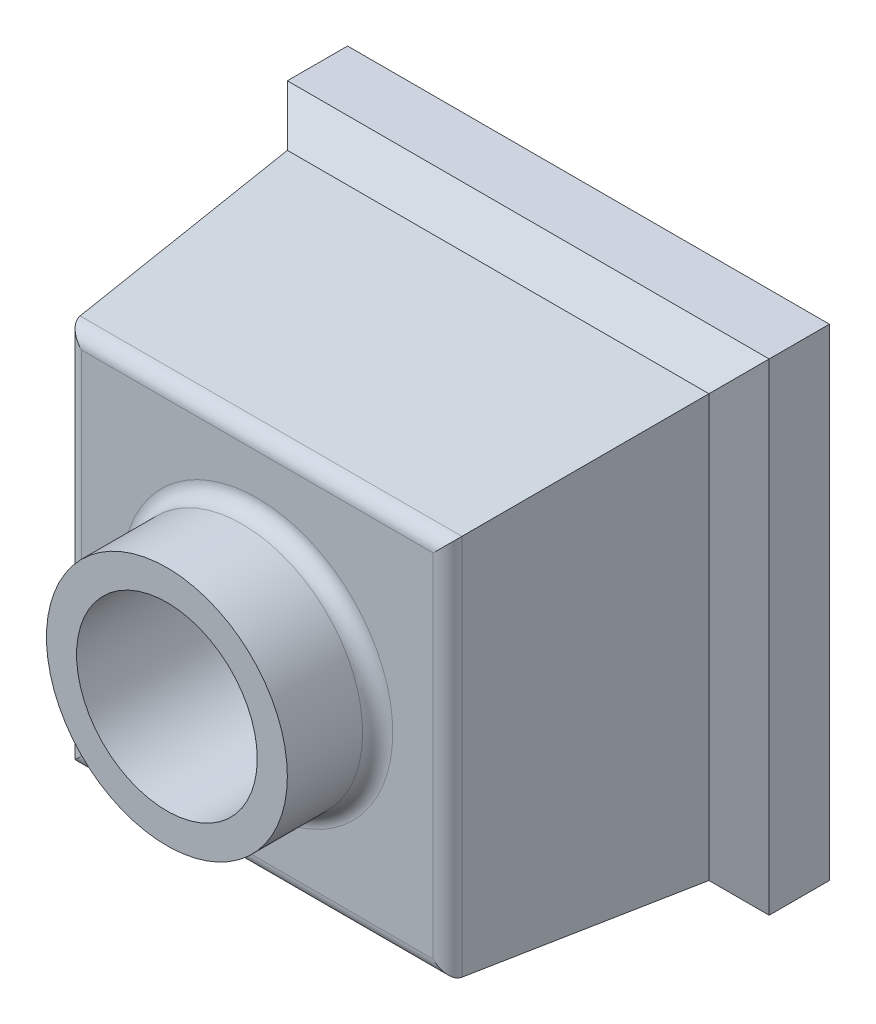
ISO-10303-21;
HEADER;
FILE_DESCRIPTION(('STEP AP214'),'2;1');
FILE_NAME('part.step','',(''),(''),'','','');
FILE_SCHEMA(('AUTOMOTIVE_DESIGN { 1 0 10303 214 1 1 1 1 }'));
ENDSEC;
DATA;
#1=APPLICATION_CONTEXT('core data for automotive mechanical design processes');
#2=APPLICATION_PROTOCOL_DEFINITION('international standard','automotive_design',2000,#1);
#3=PRODUCT_CONTEXT('',#1,'mechanical');
#4=PRODUCT('Part','Part','',(#3));
#5=PRODUCT_RELATED_PRODUCT_CATEGORY('part','',(#4));
#6=PRODUCT_DEFINITION_FORMATION('','',#4);
#7=PRODUCT_DEFINITION_CONTEXT('part definition',#1,'design');
#8=PRODUCT_DEFINITION('design','',#6,#7);
#9=PRODUCT_DEFINITION_SHAPE('','',#8);
#10=(LENGTH_UNIT() NAMED_UNIT(*) SI_UNIT(.MILLI.,.METRE.));
#11=(NAMED_UNIT(*) PLANE_ANGLE_UNIT() SI_UNIT($,.RADIAN.));
#12=(NAMED_UNIT(*) SI_UNIT($,.STERADIAN.) SOLID_ANGLE_UNIT());
#13=UNCERTAINTY_MEASURE_WITH_UNIT(LENGTH_MEASURE(1.E-05),#10,'distance_accuracy_value','');
#14=(GEOMETRIC_REPRESENTATION_CONTEXT(3) GLOBAL_UNCERTAINTY_ASSIGNED_CONTEXT((#13)) GLOBAL_UNIT_ASSIGNED_CONTEXT((#10,
#11,#12)) REPRESENTATION_CONTEXT('',''));
#15=CARTESIAN_POINT('',(0.,0.,0.));
#16=DIRECTION('',(0.,0.,1.));
#17=DIRECTION('',(1.,0.,0.));
#18=AXIS2_PLACEMENT_3D('',#15,#16,#17);
#19=CARTESIAN_POINT('',(0.,0.,30.));
#20=DIRECTION('',(1.,0.,0.));
#21=DIRECTION('',(0.,0.,-1.));
#22=AXIS2_PLACEMENT_3D('',#19,#20,#21);
#23=PLANE('',#22);
#24=DIRECTION('',(0.,0.,-1.));
#25=VECTOR('',#24,1.);
#26=CARTESIAN_POINT('',(0.,0.,30.));
#27=LINE('',#26,#25);
#28=CARTESIAN_POINT('',(0.,0.,20.));
#29=VERTEX_POINT('',#28);
#30=CARTESIAN_POINT('',(0.,0.,0.));
#31=VERTEX_POINT('',#30);
#32=EDGE_CURVE('E189',#29,#31,#27,.T.);
#33=ORIENTED_EDGE('',*,*,#32,.F.);
#34=DIRECTION('',(0.,1.,0.));
#35=VECTOR('',#34,1.);
#36=CARTESIAN_POINT('',(0.,0.,20.));
#37=LINE('',#36,#35);
#38=CARTESIAN_POINT('',(0.,160.,20.));
#39=VERTEX_POINT('',#38);
#40=EDGE_CURVE('E153',#29,#39,#37,.T.);
#41=ORIENTED_EDGE('',*,*,#40,.T.);
#42=DIRECTION('',(0.,0.,-1.));
#43=VECTOR('',#42,1.);
#44=CARTESIAN_POINT('',(0.,160.,30.));
#45=LINE('',#44,#43);
#46=CARTESIAN_POINT('',(0.,160.,0.));
#47=VERTEX_POINT('',#46);
#48=EDGE_CURVE('E199',#39,#47,#45,.T.);
#49=ORIENTED_EDGE('',*,*,#48,.T.);
#50=DIRECTION('',(0.,-1.,0.));
#51=VECTOR('',#50,1.);
#52=CARTESIAN_POINT('',(0.,0.,0.));
#53=LINE('',#52,#51);
#54=EDGE_CURVE('E210',#47,#31,#53,.T.);
#55=ORIENTED_EDGE('',*,*,#54,.T.);
#56=EDGE_LOOP('',(#33,#41,#49,#55));
#57=FACE_BOUND('',#56,.T.);
#58=ADVANCED_FACE('F33',(#57),#23,.F.);
#59=CARTESIAN_POINT('',(0.,0.,30.));
#60=DIRECTION('',(0.,1.,0.));
#61=DIRECTION('',(0.,0.,1.));
#62=AXIS2_PLACEMENT_3D('',#59,#60,#61);
#63=PLANE('',#62);
#64=DIRECTION('',(0.,0.,-1.));
#65=VECTOR('',#64,1.);
#66=CARTESIAN_POINT('',(160.,0.,30.));
#67=LINE('',#66,#65);
#68=CARTESIAN_POINT('',(160.,0.,20.));
#69=VERTEX_POINT('',#68);
#70=CARTESIAN_POINT('',(160.,0.,0.));
#71=VERTEX_POINT('',#70);
#72=EDGE_CURVE('E195',#69,#71,#67,.T.);
#73=ORIENTED_EDGE('',*,*,#72,.F.);
#74=DIRECTION('',(-1.,0.,0.));
#75=VECTOR('',#74,1.);
#76=CARTESIAN_POINT('',(0.,0.,20.));
#77=LINE('',#76,#75);
#78=EDGE_CURVE('E144',#69,#29,#77,.T.);
#79=ORIENTED_EDGE('',*,*,#78,.T.);
#80=ORIENTED_EDGE('',*,*,#32,.T.);
#81=DIRECTION('',(1.,0.,0.));
#82=VECTOR('',#81,1.);
#83=CARTESIAN_POINT('',(0.,0.,0.));
#84=LINE('',#83,#82);
#85=EDGE_CURVE('E207',#31,#71,#84,.T.);
#86=ORIENTED_EDGE('',*,*,#85,.T.);
#87=EDGE_LOOP('',(#73,#79,#80,#86));
#88=FACE_BOUND('',#87,.T.);
#89=ADVANCED_FACE('F245',(#88),#63,.F.);
#90=CARTESIAN_POINT('',(160.,0.,30.));
#91=DIRECTION('',(-1.,0.,0.));
#92=DIRECTION('',(0.,0.,1.));
#93=AXIS2_PLACEMENT_3D('',#90,#91,#92);
#94=PLANE('',#93);
#95=DIRECTION('',(0.,0.,-1.));
#96=VECTOR('',#95,1.);
#97=CARTESIAN_POINT('',(160.,160.,30.));
#98=LINE('',#97,#96);
#99=CARTESIAN_POINT('',(160.,160.,20.));
#100=VERTEX_POINT('',#99);
#101=CARTESIAN_POINT('',(160.,160.,0.));
#102=VERTEX_POINT('',#101);
#103=EDGE_CURVE('E197',#100,#102,#98,.T.);
#104=ORIENTED_EDGE('',*,*,#103,.F.);
#105=DIRECTION('',(0.,-1.,0.));
#106=VECTOR('',#105,1.);
#107=CARTESIAN_POINT('',(160.,0.,20.));
#108=LINE('',#107,#106);
#109=EDGE_CURVE('E42',#100,#69,#108,.T.);
#110=ORIENTED_EDGE('',*,*,#109,.T.);
#111=ORIENTED_EDGE('',*,*,#72,.T.);
#112=DIRECTION('',(0.,1.,0.));
#113=VECTOR('',#112,1.);
#114=CARTESIAN_POINT('',(160.,0.,0.));
#115=LINE('',#114,#113);
#116=EDGE_CURVE('E204',#71,#102,#115,.T.);
#117=ORIENTED_EDGE('',*,*,#116,.T.);
#118=EDGE_LOOP('',(#104,#110,#111,#117));
#119=FACE_BOUND('',#118,.T.);
#120=ADVANCED_FACE('F252',(#119),#94,.F.);
#121=CARTESIAN_POINT('',(0.,160.,30.));
#122=DIRECTION('',(0.,-1.,0.));
#123=DIRECTION('',(0.,0.,-1.));
#124=AXIS2_PLACEMENT_3D('',#121,#122,#123);
#125=PLANE('',#124);
#126=ORIENTED_EDGE('',*,*,#48,.F.);
#127=DIRECTION('',(1.,0.,0.));
#128=VECTOR('',#127,1.);
#129=CARTESIAN_POINT('',(0.,160.,20.));
#130=LINE('',#129,#128);
#131=EDGE_CURVE('E11',#39,#100,#130,.T.);
#132=ORIENTED_EDGE('',*,*,#131,.T.);
#133=ORIENTED_EDGE('',*,*,#103,.T.);
#134=DIRECTION('',(-1.,0.,0.));
#135=VECTOR('',#134,1.);
#136=CARTESIAN_POINT('',(0.,160.,0.));
#137=LINE('',#136,#135);
#138=EDGE_CURVE('E201',#102,#47,#137,.T.);
#139=ORIENTED_EDGE('',*,*,#138,.T.);
#140=EDGE_LOOP('',(#126,#132,#133,#139));
#141=FACE_BOUND('',#140,.T.);
#142=ADVANCED_FACE('F305',(#141),#125,.F.);
#143=CARTESIAN_POINT('',(0.,0.,0.));
#144=DIRECTION('',(0.,0.,-1.));
#145=DIRECTION('',(-1.,0.,0.));
#146=AXIS2_PLACEMENT_3D('',#143,#144,#145);
#147=PLANE('',#146);
#148=CARTESIAN_POINT('',(80.,80.,0.));
#149=DIRECTION('',(0.,0.,1.));
#150=DIRECTION('',(1.,0.,0.));
#151=AXIS2_PLACEMENT_3D('',#148,#149,#150);
#152=CIRCLE('',#151,30.);
#153=CARTESIAN_POINT('',(110.,80.,0.));
#154=VERTEX_POINT('',#153);
#155=EDGE_CURVE('E160',#154,#154,#152,.T.);
#156=ORIENTED_EDGE('',*,*,#155,.T.);
#157=EDGE_LOOP('',(#156));
#158=FACE_BOUND('',#157,.T.);
#159=ORIENTED_EDGE('',*,*,#54,.F.);
#160=ORIENTED_EDGE('',*,*,#138,.F.);
#161=ORIENTED_EDGE('',*,*,#116,.F.);
#162=ORIENTED_EDGE('',*,*,#85,.F.);
#163=EDGE_LOOP('',(#159,#160,#161,#162));
#164=FACE_BOUND('',#163,.T.);
#165=ADVANCED_FACE('F225',(#158,#164),#147,.T.);
#166=CARTESIAN_POINT('',(10.,150.,30.));
#167=DIRECTION('',(-0.996194698091746,0.,0.0871557427476582));
#168=DIRECTION('',(0.0871557427476582,0.,0.996194698091746));
#169=AXIS2_PLACEMENT_3D('',#166,#167,#168);
#170=PLANE('',#169);
#171=DIRECTION('',(-0.0868265938642476,-0.0868265938642476,-0.992432509138967));
#172=VECTOR('',#171,1.);
#173=CARTESIAN_POINT('',(10.,10.,30.));
#174=LINE('',#173,#172);
#175=CARTESIAN_POINT('',(16.5997754617023,16.5997754617023,105.435778713738));
#176=VERTEX_POINT('',#175);
#177=CARTESIAN_POINT('',(10.,10.,30.));
#178=VERTEX_POINT('',#177);
#179=EDGE_CURVE('E121',#176,#178,#174,.T.);
#180=ORIENTED_EDGE('',*,*,#179,.F.);
#181=DIRECTION('',(0.,-1.,0.));
#182=VECTOR('',#181,1.);
#183=CARTESIAN_POINT('',(16.5997754617023,143.000906917926,105.435778713738));
#184=LINE('',#183,#182);
#185=CARTESIAN_POINT('',(16.5997754617023,143.400224538298,105.435778713738));
#186=VERTEX_POINT('',#185);
#187=EDGE_CURVE('E169',#176,#186,#184,.F.);
#188=ORIENTED_EDGE('',*,*,#187,.T.);
#189=DIRECTION('',(-0.0868265938642476,0.0868265938642476,-0.992432509138967));
#190=VECTOR('',#189,1.);
#191=CARTESIAN_POINT('',(10.,150.,30.));
#192=LINE('',#191,#190);
#193=CARTESIAN_POINT('',(10.,150.,30.));
#194=VERTEX_POINT('',#193);
#195=EDGE_CURVE('E214',#186,#194,#192,.T.);
#196=ORIENTED_EDGE('',*,*,#195,.T.);
#197=DIRECTION('',(0.,-1.,0.));
#198=VECTOR('',#197,1.);
#199=CARTESIAN_POINT('',(10.,150.,30.));
#200=LINE('',#199,#198);
#201=EDGE_CURVE('E133',#194,#178,#200,.T.);
#202=ORIENTED_EDGE('',*,*,#201,.T.);
#203=EDGE_LOOP('',(#180,#188,#196,#202));
#204=FACE_BOUND('',#203,.T.);
#205=ADVANCED_FACE('F303',(#204),#170,.T.);
#206=CARTESIAN_POINT('',(10.,10.,30.));
#207=DIRECTION('',(0.,-0.996194698091746,0.0871557427476582));
#208=DIRECTION('',(0.,-0.0871557427476582,-0.996194698091746));
#209=AXIS2_PLACEMENT_3D('',#206,#207,#208);
#210=PLANE('',#209);
#211=DIRECTION('',(0.0868265938642476,-0.0868265938642476,-0.992432509138967));
#212=VECTOR('',#211,1.);
#213=CARTESIAN_POINT('',(150.,10.,30.));
#214=LINE('',#213,#212);
#215=CARTESIAN_POINT('',(143.400224538298,16.5997754617023,105.435778713738));
#216=VERTEX_POINT('',#215);
#217=CARTESIAN_POINT('',(150.,10.,30.));
#218=VERTEX_POINT('',#217);
#219=EDGE_CURVE('E110',#216,#218,#214,.T.);
#220=ORIENTED_EDGE('',*,*,#219,.F.);
#221=DIRECTION('',(1.,0.,0.));
#222=VECTOR('',#221,1.);
#223=CARTESIAN_POINT('',(16.9990930820739,16.5997754617023,105.435778713738));
#224=LINE('',#223,#222);
#225=EDGE_CURVE('E171',#216,#176,#224,.F.);
#226=ORIENTED_EDGE('',*,*,#225,.T.);
#227=ORIENTED_EDGE('',*,*,#179,.T.);
#228=DIRECTION('',(1.,0.,0.));
#229=VECTOR('',#228,1.);
#230=CARTESIAN_POINT('',(10.,10.,30.));
#231=LINE('',#230,#229);
#232=EDGE_CURVE('E126',#178,#218,#231,.T.);
#233=ORIENTED_EDGE('',*,*,#232,.T.);
#234=EDGE_LOOP('',(#220,#226,#227,#233));
#235=FACE_BOUND('',#234,.T.);
#236=ADVANCED_FACE('F127',(#235),#210,.T.);
#237=CARTESIAN_POINT('',(150.,10.,30.));
#238=DIRECTION('',(0.996194698091746,0.,0.0871557427476582));
#239=DIRECTION('',(0.0871557427476582,0.,-0.996194698091746));
#240=AXIS2_PLACEMENT_3D('',#237,#238,#239);
#241=PLANE('',#240);
#242=DIRECTION('',(0.0868265938642476,0.0868265938642476,-0.992432509138967));
#243=VECTOR('',#242,1.);
#244=CARTESIAN_POINT('',(150.,150.,30.));
#245=LINE('',#244,#243);
#246=CARTESIAN_POINT('',(143.400224538298,143.400224538298,105.435778713738));
#247=VERTEX_POINT('',#246);
#248=CARTESIAN_POINT('',(150.,150.,30.));
#249=VERTEX_POINT('',#248);
#250=EDGE_CURVE('E122',#247,#249,#245,.T.);
#251=ORIENTED_EDGE('',*,*,#250,.F.);
#252=DIRECTION('',(0.,1.,0.));
#253=VECTOR('',#252,1.);
#254=CARTESIAN_POINT('',(143.400224538298,16.9990930820739,105.435778713738));
#255=LINE('',#254,#253);
#256=EDGE_CURVE('E118',#247,#216,#255,.F.);
#257=ORIENTED_EDGE('',*,*,#256,.T.);
#258=ORIENTED_EDGE('',*,*,#219,.T.);
#259=DIRECTION('',(0.,1.,0.));
#260=VECTOR('',#259,1.);
#261=CARTESIAN_POINT('',(150.,10.,30.));
#262=LINE('',#261,#260);
#263=EDGE_CURVE('E115',#218,#249,#262,.T.);
#264=ORIENTED_EDGE('',*,*,#263,.T.);
#265=EDGE_LOOP('',(#251,#257,#258,#264));
#266=FACE_BOUND('',#265,.T.);
#267=ADVANCED_FACE('F113',(#266),#241,.T.);
#268=CARTESIAN_POINT('',(150.,150.,30.));
#269=DIRECTION('',(0.,0.996194698091746,0.0871557427476582));
#270=DIRECTION('',(0.,-0.0871557427476582,0.996194698091746));
#271=AXIS2_PLACEMENT_3D('',#268,#269,#270);
#272=PLANE('',#271);
#273=ORIENTED_EDGE('',*,*,#195,.F.);
#274=DIRECTION('',(-1.,0.,0.));
#275=VECTOR('',#274,1.);
#276=CARTESIAN_POINT('',(143.000906917926,143.400224538298,105.435778713738));
#277=LINE('',#276,#275);
#278=EDGE_CURVE('E174',#186,#247,#277,.F.);
#279=ORIENTED_EDGE('',*,*,#278,.T.);
#280=ORIENTED_EDGE('',*,*,#250,.T.);
#281=DIRECTION('',(-1.,0.,0.));
#282=VECTOR('',#281,1.);
#283=CARTESIAN_POINT('',(150.,150.,30.));
#284=LINE('',#283,#282);
#285=EDGE_CURVE('E141',#249,#194,#284,.T.);
#286=ORIENTED_EDGE('',*,*,#285,.T.);
#287=EDGE_LOOP('',(#273,#279,#280,#286));
#288=FACE_BOUND('',#287,.T.);
#289=ADVANCED_FACE('F288',(#288),#272,.T.);
#290=CARTESIAN_POINT('',(0.,0.,110.));
#291=DIRECTION('',(0.,0.,1.));
#292=DIRECTION('',(1.,0.,0.));
#293=AXIS2_PLACEMENT_3D('',#290,#291,#292);
#294=PLANE('',#293);
#295=DIRECTION('',(0.,-1.,0.));
#296=VECTOR('',#295,1.);
#297=CARTESIAN_POINT('',(138.419251047839,143.000906917926,110.));
#298=LINE('',#297,#296);
#299=CARTESIAN_POINT('',(138.419251047839,21.580748952161,110.));
#300=VERTEX_POINT('',#299);
#301=CARTESIAN_POINT('',(138.419251047839,138.419251047839,110.));
#302=VERTEX_POINT('',#301);
#303=EDGE_CURVE('E180',#300,#302,#298,.F.);
#304=ORIENTED_EDGE('',*,*,#303,.T.);
#305=DIRECTION('',(1.,0.,0.));
#306=VECTOR('',#305,1.);
#307=CARTESIAN_POINT('',(16.9990930820739,138.419251047839,110.));
#308=LINE('',#307,#306);
#309=CARTESIAN_POINT('',(21.580748952161,138.419251047839,110.));
#310=VERTEX_POINT('',#309);
#311=EDGE_CURVE('E177',#302,#310,#308,.F.);
#312=ORIENTED_EDGE('',*,*,#311,.T.);
#313=DIRECTION('',(0.,1.,0.));
#314=VECTOR('',#313,1.);
#315=CARTESIAN_POINT('',(21.580748952161,16.9990930820739,110.));
#316=LINE('',#315,#314);
#317=CARTESIAN_POINT('',(21.580748952161,21.580748952161,110.));
#318=VERTEX_POINT('',#317);
#319=EDGE_CURVE('E184',#310,#318,#316,.F.);
#320=ORIENTED_EDGE('',*,*,#319,.T.);
#321=DIRECTION('',(-1.,0.,0.));
#322=VECTOR('',#321,1.);
#323=CARTESIAN_POINT('',(143.000906917926,21.580748952161,110.));
#324=LINE('',#323,#322);
#325=EDGE_CURVE('E182',#318,#300,#324,.F.);
#326=ORIENTED_EDGE('',*,*,#325,.T.);
#327=EDGE_LOOP('',(#304,#312,#320,#326));
#328=FACE_BOUND('',#327,.T.);
#329=CARTESIAN_POINT('',(80.,80.,110.));
#330=DIRECTION('',(0.,0.,1.));
#331=DIRECTION('',(1.,0.,0.));
#332=AXIS2_PLACEMENT_3D('',#329,#330,#331);
#333=CIRCLE('',#332,45.);
#334=CARTESIAN_POINT('',(125.,80.,110.));
#335=VERTEX_POINT('',#334);
#336=EDGE_CURVE('E186',#335,#335,#333,.F.);
#337=ORIENTED_EDGE('',*,*,#336,.T.);
#338=EDGE_LOOP('',(#337));
#339=FACE_BOUND('',#338,.T.);
#340=ADVANCED_FACE('F298',(#328,#339),#294,.T.);
#341=CARTESIAN_POINT('',(80.,80.,140.));
#342=DIRECTION('',(0.,0.,-1.));
#343=DIRECTION('',(-1.,0.,0.));
#344=AXIS2_PLACEMENT_3D('',#341,#342,#343);
#345=CYLINDRICAL_SURFACE('',#344,40.);
#346=CARTESIAN_POINT('',(80.,80.,115.));
#347=DIRECTION('',(0.,0.,1.));
#348=DIRECTION('',(1.,0.,0.));
#349=AXIS2_PLACEMENT_3D('',#346,#347,#348);
#350=CIRCLE('',#349,40.);
#351=CARTESIAN_POINT('',(120.,80.,115.));
#352=VERTEX_POINT('',#351);
#353=EDGE_CURVE('E156',#352,#352,#350,.T.);
#354=ORIENTED_EDGE('',*,*,#353,.T.);
#355=EDGE_LOOP('',(#354));
#356=FACE_BOUND('',#355,.T.);
#357=CARTESIAN_POINT('',(80.,80.,140.));
#358=DIRECTION('',(0.,0.,1.));
#359=DIRECTION('',(1.,0.,0.));
#360=AXIS2_PLACEMENT_3D('',#357,#358,#359);
#361=CIRCLE('',#360,40.);
#362=CARTESIAN_POINT('',(120.,80.,140.));
#363=VERTEX_POINT('',#362);
#364=EDGE_CURVE('E193',#363,#363,#361,.T.);
#365=ORIENTED_EDGE('',*,*,#364,.F.);
#366=EDGE_LOOP('',(#365));
#367=FACE_BOUND('',#366,.T.);
#368=ADVANCED_FACE('F241',(#356,#367),#345,.T.);
#369=CARTESIAN_POINT('',(80.,80.,140.));
#370=DIRECTION('',(0.,0.,1.));
#371=DIRECTION('',(1.,0.,0.));
#372=AXIS2_PLACEMENT_3D('',#369,#370,#371);
#373=PLANE('',#372);
#374=CARTESIAN_POINT('',(80.,80.,140.));
#375=DIRECTION('',(0.,0.,1.));
#376=DIRECTION('',(1.,0.,0.));
#377=AXIS2_PLACEMENT_3D('',#374,#375,#376);
#378=CIRCLE('',#377,30.);
#379=CARTESIAN_POINT('',(110.,80.,140.));
#380=VERTEX_POINT('',#379);
#381=EDGE_CURVE('E190',#380,#380,#378,.T.);
#382=ORIENTED_EDGE('',*,*,#381,.F.);
#383=EDGE_LOOP('',(#382));
#384=FACE_BOUND('',#383,.T.);
#385=ORIENTED_EDGE('',*,*,#364,.T.);
#386=EDGE_LOOP('',(#385));
#387=FACE_BOUND('',#386,.T.);
#388=ADVANCED_FACE('F231',(#384,#387),#373,.T.);
#389=CARTESIAN_POINT('',(80.,80.,0.));
#390=DIRECTION('',(0.,0.,1.));
#391=DIRECTION('',(1.,0.,0.));
#392=AXIS2_PLACEMENT_3D('',#389,#390,#391);
#393=CYLINDRICAL_SURFACE('',#392,30.);
#394=ORIENTED_EDGE('',*,*,#381,.T.);
#395=EDGE_LOOP('',(#394));
#396=FACE_BOUND('',#395,.T.);
#397=ORIENTED_EDGE('',*,*,#155,.F.);
#398=EDGE_LOOP('',(#397));
#399=FACE_BOUND('',#398,.T.);
#400=ADVANCED_FACE('F228',(#396,#399),#393,.F.);
#401=CARTESIAN_POINT('',(0.,21.580748952161,105.));
#402=DIRECTION('',(1.,0.,0.));
#403=DIRECTION('',(0.,0.,-1.));
#404=AXIS2_PLACEMENT_3D('',#401,#402,#403);
#405=CYLINDRICAL_SURFACE('',#404,5.);
#406=CARTESIAN_POINT('',(21.580748952161,21.580748952161,105.));
#407=DIRECTION('',(0.707106781186547,-0.707106781186547,0.));
#408=DIRECTION('',(-0.707106781186547,-0.707106781186547,0.));
#409=AXIS2_PLACEMENT_3D('',#406,#407,#408);
#410=ELLIPSE('',#409,7.07106781186547,5.);
#411=EDGE_CURVE('E161',#176,#318,#410,.F.);
#412=ORIENTED_EDGE('',*,*,#411,.F.);
#413=ORIENTED_EDGE('',*,*,#225,.F.);
#414=CARTESIAN_POINT('',(138.419251047839,21.580748952161,105.));
#415=DIRECTION('',(0.707106781186547,0.707106781186547,0.));
#416=DIRECTION('',(0.707106781186547,-0.707106781186547,0.));
#417=AXIS2_PLACEMENT_3D('',#414,#415,#416);
#418=ELLIPSE('',#417,7.07106781186547,5.);
#419=EDGE_CURVE('E157',#300,#216,#418,.T.);
#420=ORIENTED_EDGE('',*,*,#419,.F.);
#421=ORIENTED_EDGE('',*,*,#325,.F.);
#422=EDGE_LOOP('',(#412,#413,#420,#421));
#423=FACE_BOUND('',#422,.T.);
#424=ADVANCED_FACE('F230',(#423),#405,.T.);
#425=CARTESIAN_POINT('',(138.419251047839,0.,105.));
#426=DIRECTION('',(0.,1.,0.));
#427=DIRECTION('',(0.,0.,1.));
#428=AXIS2_PLACEMENT_3D('',#425,#426,#427);
#429=CYLINDRICAL_SURFACE('',#428,5.);
#430=ORIENTED_EDGE('',*,*,#419,.T.);
#431=ORIENTED_EDGE('',*,*,#256,.F.);
#432=CARTESIAN_POINT('',(138.419251047839,138.419251047839,105.));
#433=DIRECTION('',(-0.707106781186547,0.707106781186547,0.));
#434=DIRECTION('',(0.707106781186547,0.707106781186547,0.));
#435=AXIS2_PLACEMENT_3D('',#432,#433,#434);
#436=ELLIPSE('',#435,7.07106781186547,5.);
#437=EDGE_CURVE('E164',#302,#247,#436,.T.);
#438=ORIENTED_EDGE('',*,*,#437,.F.);
#439=ORIENTED_EDGE('',*,*,#303,.F.);
#440=EDGE_LOOP('',(#430,#431,#438,#439));
#441=FACE_BOUND('',#440,.T.);
#442=ADVANCED_FACE('F238',(#441),#429,.T.);
#443=CARTESIAN_POINT('',(21.580748952161,0.,105.));
#444=DIRECTION('',(0.,-1.,0.));
#445=DIRECTION('',(0.,0.,-1.));
#446=AXIS2_PLACEMENT_3D('',#443,#444,#445);
#447=CYLINDRICAL_SURFACE('',#446,5.);
#448=ORIENTED_EDGE('',*,*,#411,.T.);
#449=ORIENTED_EDGE('',*,*,#319,.F.);
#450=CARTESIAN_POINT('',(21.580748952161,138.419251047839,105.));
#451=DIRECTION('',(-0.707106781186547,-0.707106781186547,0.));
#452=DIRECTION('',(0.707106781186547,-0.707106781186547,0.));
#453=AXIS2_PLACEMENT_3D('',#450,#451,#452);
#454=ELLIPSE('',#453,7.07106781186547,5.);
#455=EDGE_CURVE('E146',#186,#310,#454,.F.);
#456=ORIENTED_EDGE('',*,*,#455,.F.);
#457=ORIENTED_EDGE('',*,*,#187,.F.);
#458=EDGE_LOOP('',(#448,#449,#456,#457));
#459=FACE_BOUND('',#458,.T.);
#460=ADVANCED_FACE('F262',(#459),#447,.T.);
#461=CARTESIAN_POINT('',(0.,138.419251047839,105.));
#462=DIRECTION('',(-1.,0.,0.));
#463=DIRECTION('',(0.,0.,1.));
#464=AXIS2_PLACEMENT_3D('',#461,#462,#463);
#465=CYLINDRICAL_SURFACE('',#464,5.);
#466=ORIENTED_EDGE('',*,*,#437,.T.);
#467=ORIENTED_EDGE('',*,*,#278,.F.);
#468=ORIENTED_EDGE('',*,*,#455,.T.);
#469=ORIENTED_EDGE('',*,*,#311,.F.);
#470=EDGE_LOOP('',(#466,#467,#468,#469));
#471=FACE_BOUND('',#470,.T.);
#472=ADVANCED_FACE('F258',(#471),#465,.T.);
#473=CARTESIAN_POINT('',(80.,80.,115.));
#474=DIRECTION('',(0.,0.,1.));
#475=DIRECTION('',(1.,0.,0.));
#476=AXIS2_PLACEMENT_3D('',#473,#474,#475);
#477=TOROIDAL_SURFACE('',#476,45.,5.);
#478=ORIENTED_EDGE('',*,*,#336,.F.);
#479=EDGE_LOOP('',(#478));
#480=FACE_BOUND('',#479,.T.);
#481=ORIENTED_EDGE('',*,*,#353,.F.);
#482=EDGE_LOOP('',(#481));
#483=FACE_BOUND('',#482,.T.);
#484=ADVANCED_FACE('F261',(#480,#483),#477,.F.);
#485=CARTESIAN_POINT('',(150.,0.,30.));
#486=DIRECTION('',(-0.707106781186548,0.,-0.707106781186546));
#487=DIRECTION('',(0.,1.,0.));
#488=AXIS2_PLACEMENT_3D('',#485,#486,#487);
#489=PLANE('',#488);
#490=DIRECTION('',(0.577350269189625,-0.577350269189625,-0.577350269189627));
#491=VECTOR('',#490,1.);
#492=CARTESIAN_POINT('',(153.333333333333,6.66666666666666,26.6666666666667));
#493=LINE('',#492,#491);
#494=EDGE_CURVE('E137',#69,#218,#493,.F.);
#495=ORIENTED_EDGE('',*,*,#494,.F.);
#496=ORIENTED_EDGE('',*,*,#109,.F.);
#497=DIRECTION('',(0.577350269189625,0.577350269189625,-0.577350269189627));
#498=VECTOR('',#497,1.);
#499=CARTESIAN_POINT('',(100.,100.,80.));
#500=LINE('',#499,#498);
#501=EDGE_CURVE('E37',#249,#100,#500,.T.);
#502=ORIENTED_EDGE('',*,*,#501,.F.);
#503=ORIENTED_EDGE('',*,*,#263,.F.);
#504=EDGE_LOOP('',(#495,#496,#502,#503));
#505=FACE_BOUND('',#504,.T.);
#506=ADVANCED_FACE('F35',(#505),#489,.F.);
#507=CARTESIAN_POINT('',(0.,150.,30.));
#508=DIRECTION('',(0.,-0.707106781186548,-0.707106781186546));
#509=DIRECTION('',(-1.,0.,0.));
#510=AXIS2_PLACEMENT_3D('',#507,#508,#509);
#511=PLANE('',#510);
#512=ORIENTED_EDGE('',*,*,#501,.T.);
#513=ORIENTED_EDGE('',*,*,#131,.F.);
#514=DIRECTION('',(0.577350269189625,-0.577350269189625,0.577350269189627));
#515=VECTOR('',#514,1.);
#516=CARTESIAN_POINT('',(6.66666666666666,153.333333333333,26.6666666666667));
#517=LINE('',#516,#515);
#518=EDGE_CURVE('E145',#194,#39,#517,.F.);
#519=ORIENTED_EDGE('',*,*,#518,.F.);
#520=ORIENTED_EDGE('',*,*,#285,.F.);
#521=EDGE_LOOP('',(#512,#513,#519,#520));
#522=FACE_BOUND('',#521,.T.);
#523=ADVANCED_FACE('F278',(#522),#511,.F.);
#524=CARTESIAN_POINT('',(0.,9.99999999999998,30.));
#525=DIRECTION('',(0.,0.707106781186548,-0.707106781186546));
#526=DIRECTION('',(1.,0.,0.));
#527=AXIS2_PLACEMENT_3D('',#524,#525,#526);
#528=PLANE('',#527);
#529=ORIENTED_EDGE('',*,*,#494,.T.);
#530=ORIENTED_EDGE('',*,*,#232,.F.);
#531=DIRECTION('',(-0.577350269189625,-0.577350269189625,-0.577350269189627));
#532=VECTOR('',#531,1.);
#533=CARTESIAN_POINT('',(6.66666666666666,6.66666666666666,26.6666666666667));
#534=LINE('',#533,#532);
#535=EDGE_CURVE('E147',#29,#178,#534,.F.);
#536=ORIENTED_EDGE('',*,*,#535,.F.);
#537=ORIENTED_EDGE('',*,*,#78,.F.);
#538=EDGE_LOOP('',(#529,#530,#536,#537));
#539=FACE_BOUND('',#538,.T.);
#540=ADVANCED_FACE('F143',(#539),#528,.F.);
#541=CARTESIAN_POINT('',(9.99999999999998,0.,30.));
#542=DIRECTION('',(0.707106781186548,0.,-0.707106781186546));
#543=DIRECTION('',(0.,-1.,0.));
#544=AXIS2_PLACEMENT_3D('',#541,#542,#543);
#545=PLANE('',#544);
#546=ORIENTED_EDGE('',*,*,#518,.T.);
#547=ORIENTED_EDGE('',*,*,#40,.F.);
#548=ORIENTED_EDGE('',*,*,#535,.T.);
#549=ORIENTED_EDGE('',*,*,#201,.F.);
#550=EDGE_LOOP('',(#546,#547,#548,#549));
#551=FACE_BOUND('',#550,.T.);
#552=ADVANCED_FACE('F273',(#551),#545,.F.);
#553=CLOSED_SHELL('',(#58,#89,#120,#142,#165,#205,#236,#267,#289,#340,#368,#388,#400,#424,#442,
#460,#472,#484,#506,#523,#540,#552));
#554=MANIFOLD_SOLID_BREP('B2',#553);
#555=ADVANCED_BREP_SHAPE_REPRESENTATION('',(#18,#554),#14);
#556=SHAPE_DEFINITION_REPRESENTATION(#9,#555);
ENDSEC;
END-ISO-10303-21;
